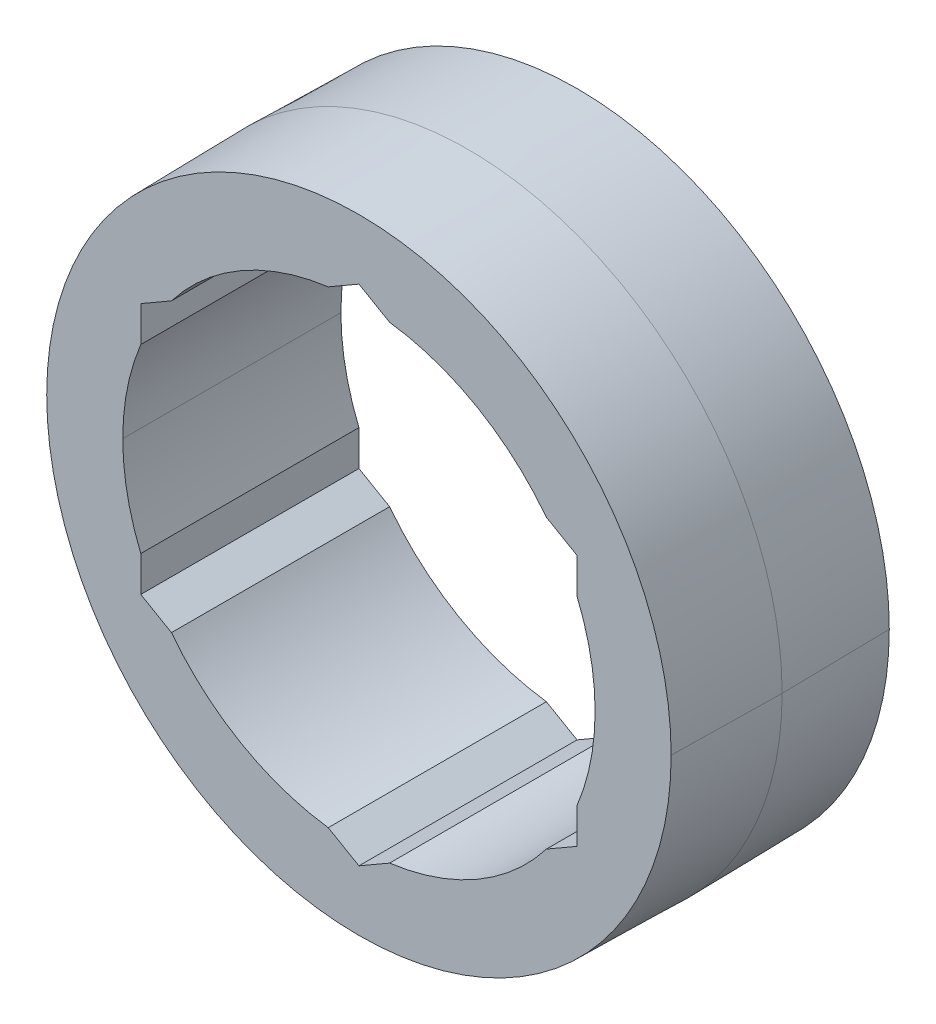
ISO-10303-21;
HEADER;
FILE_DESCRIPTION(('STEP AP214'),'2;1');
FILE_NAME('part.step','',(''),(''),'','','');
FILE_SCHEMA(('AUTOMOTIVE_DESIGN { 1 0 10303 214 1 1 1 1 }'));
ENDSEC;
DATA;
#1=APPLICATION_CONTEXT('core data for automotive mechanical design processes');
#2=APPLICATION_PROTOCOL_DEFINITION('international standard','automotive_design',2000,#1);
#3=PRODUCT_CONTEXT('',#1,'mechanical');
#4=PRODUCT('Part','Part','',(#3));
#5=PRODUCT_RELATED_PRODUCT_CATEGORY('part','',(#4));
#6=PRODUCT_DEFINITION_FORMATION('','',#4);
#7=PRODUCT_DEFINITION_CONTEXT('part definition',#1,'design');
#8=PRODUCT_DEFINITION('design','',#6,#7);
#9=PRODUCT_DEFINITION_SHAPE('','',#8);
#10=(LENGTH_UNIT() NAMED_UNIT(*) SI_UNIT(.MILLI.,.METRE.));
#11=(NAMED_UNIT(*) PLANE_ANGLE_UNIT() SI_UNIT($,.RADIAN.));
#12=(NAMED_UNIT(*) SI_UNIT($,.STERADIAN.) SOLID_ANGLE_UNIT());
#13=UNCERTAINTY_MEASURE_WITH_UNIT(LENGTH_MEASURE(1.E-05),#10,'distance_accuracy_value','');
#14=(GEOMETRIC_REPRESENTATION_CONTEXT(3) GLOBAL_UNCERTAINTY_ASSIGNED_CONTEXT((#13)) GLOBAL_UNIT_ASSIGNED_CONTEXT((#10,
#11,#12)) REPRESENTATION_CONTEXT('',''));
#15=CARTESIAN_POINT('',(0.,0.,0.));
#16=DIRECTION('',(0.,0.,1.));
#17=DIRECTION('',(1.,0.,0.));
#18=AXIS2_PLACEMENT_3D('',#15,#16,#17);
#19=CARTESIAN_POINT('',(0.,0.,-3.175));
#20=DIRECTION('',(0.,0.,1.));
#21=DIRECTION('',(1.,0.,0.));
#22=AXIS2_PLACEMENT_3D('',#19,#20,#21);
#23=PLANE('',#22);
#24=CARTESIAN_POINT('',(0.,0.,-3.175));
#25=DIRECTION('',(0.,0.,1.));
#26=DIRECTION('',(1.,0.,0.));
#27=AXIS2_PLACEMENT_3D('',#24,#25,#26);
#28=CIRCLE('',#27,6.874999966);
#29=CARTESIAN_POINT('',(5.45696042896782,4.18177084608655,-3.175));
#30=VERTEX_POINT('',#29);
#31=CARTESIAN_POINT('',(0.89303957103219,6.81675178197583,-3.175));
#32=VERTEX_POINT('',#31);
#33=EDGE_CURVE('E20',#30,#32,#28,.T.);
#34=ORIENTED_EDGE('',*,*,#33,.T.);
#35=DIRECTION('',(-0.866025403784439,0.5,0.));
#36=VECTOR('',#35,1.);
#37=CARTESIAN_POINT('',(3.175,5.49926131403119,-3.175));
#38=LINE('',#37,#36);
#39=CARTESIAN_POINT('',(0.,7.33234841870825,-3.175));
#40=VERTEX_POINT('',#39);
#41=EDGE_CURVE('E454',#32,#40,#38,.T.);
#42=ORIENTED_EDGE('',*,*,#41,.T.);
#43=DIRECTION('',(-0.866025403784439,-0.5,0.));
#44=VECTOR('',#43,1.);
#45=CARTESIAN_POINT('',(-3.175,5.49926131403119,-3.175));
#46=LINE('',#45,#44);
#47=CARTESIAN_POINT('',(-0.893039571032188,6.81675178197583,-3.175));
#48=VERTEX_POINT('',#47);
#49=EDGE_CURVE('E284',#40,#48,#46,.T.);
#50=ORIENTED_EDGE('',*,*,#49,.T.);
#51=CARTESIAN_POINT('',(0.,0.,-3.175));
#52=DIRECTION('',(0.,0.,1.));
#53=DIRECTION('',(1.,0.,0.));
#54=AXIS2_PLACEMENT_3D('',#51,#52,#53);
#55=CIRCLE('',#54,6.874999966);
#56=CARTESIAN_POINT('',(-5.45696042896781,4.18177084608655,-3.175));
#57=VERTEX_POINT('',#56);
#58=EDGE_CURVE('E385',#48,#57,#55,.T.);
#59=ORIENTED_EDGE('',*,*,#58,.T.);
#60=DIRECTION('',(-0.866025403784439,-0.5,0.));
#61=VECTOR('',#60,1.);
#62=CARTESIAN_POINT('',(-3.175,5.49926131403119,-3.175));
#63=LINE('',#62,#61);
#64=CARTESIAN_POINT('',(-6.35,3.66617420935413,-3.175));
#65=VERTEX_POINT('',#64);
#66=EDGE_CURVE('E402',#57,#65,#63,.T.);
#67=ORIENTED_EDGE('',*,*,#66,.T.);
#68=DIRECTION('',(0.,-1.,0.));
#69=VECTOR('',#68,1.);
#70=CARTESIAN_POINT('',(-6.35,0.,-3.175));
#71=LINE('',#70,#69);
#72=CARTESIAN_POINT('',(-6.35,2.63498093588929,-3.175));
#73=VERTEX_POINT('',#72);
#74=EDGE_CURVE('E458',#65,#73,#71,.T.);
#75=ORIENTED_EDGE('',*,*,#74,.T.);
#76=CARTESIAN_POINT('',(0.,0.,-3.175));
#77=DIRECTION('',(0.,0.,1.));
#78=DIRECTION('',(1.,0.,0.));
#79=AXIS2_PLACEMENT_3D('',#76,#77,#78);
#80=CIRCLE('',#79,6.874999966);
#81=CARTESIAN_POINT('',(-6.874999966,0.,-3.175));
#82=VERTEX_POINT('',#81);
#83=EDGE_CURVE('E375',#73,#82,#80,.T.);
#84=ORIENTED_EDGE('',*,*,#83,.T.);
#85=CARTESIAN_POINT('',(0.,0.,-3.175));
#86=DIRECTION('',(0.,0.,1.));
#87=DIRECTION('',(1.,0.,0.));
#88=AXIS2_PLACEMENT_3D('',#85,#86,#87);
#89=CIRCLE('',#88,6.874999966);
#90=CARTESIAN_POINT('',(-6.35,-2.63498093588929,-3.175));
#91=VERTEX_POINT('',#90);
#92=EDGE_CURVE('E456',#82,#91,#89,.T.);
#93=ORIENTED_EDGE('',*,*,#92,.T.);
#94=DIRECTION('',(0.,-1.,0.));
#95=VECTOR('',#94,1.);
#96=CARTESIAN_POINT('',(-6.35,0.,-3.175));
#97=LINE('',#96,#95);
#98=CARTESIAN_POINT('',(-6.35,-3.66617420935412,-3.175));
#99=VERTEX_POINT('',#98);
#100=EDGE_CURVE('E325',#91,#99,#97,.T.);
#101=ORIENTED_EDGE('',*,*,#100,.T.);
#102=DIRECTION('',(0.866025403784439,-0.5,0.));
#103=VECTOR('',#102,1.);
#104=CARTESIAN_POINT('',(-3.175,-5.49926131403119,-3.175));
#105=LINE('',#104,#103);
#106=CARTESIAN_POINT('',(-5.45696042896782,-4.18177084608655,-3.175));
#107=VERTEX_POINT('',#106);
#108=EDGE_CURVE('E118',#99,#107,#105,.T.);
#109=ORIENTED_EDGE('',*,*,#108,.T.);
#110=CARTESIAN_POINT('',(0.,0.,-3.175));
#111=DIRECTION('',(0.,0.,1.));
#112=DIRECTION('',(1.,0.,0.));
#113=AXIS2_PLACEMENT_3D('',#110,#111,#112);
#114=CIRCLE('',#113,6.874999966);
#115=CARTESIAN_POINT('',(-0.893039571032186,-6.81675178197583,-3.175));
#116=VERTEX_POINT('',#115);
#117=EDGE_CURVE('E367',#107,#116,#114,.T.);
#118=ORIENTED_EDGE('',*,*,#117,.T.);
#119=DIRECTION('',(0.866025403784439,-0.5,0.));
#120=VECTOR('',#119,1.);
#121=CARTESIAN_POINT('',(-3.175,-5.49926131403119,-3.175));
#122=LINE('',#121,#120);
#123=CARTESIAN_POINT('',(0.,-7.33234841870825,-3.175));
#124=VERTEX_POINT('',#123);
#125=EDGE_CURVE('E362',#116,#124,#122,.T.);
#126=ORIENTED_EDGE('',*,*,#125,.T.);
#127=DIRECTION('',(0.866025403784439,0.5,0.));
#128=VECTOR('',#127,1.);
#129=CARTESIAN_POINT('',(3.175,-5.49926131403119,-3.175));
#130=LINE('',#129,#128);
#131=CARTESIAN_POINT('',(0.893039571032181,-6.81675178197583,-3.175));
#132=VERTEX_POINT('',#131);
#133=EDGE_CURVE('E324',#124,#132,#130,.T.);
#134=ORIENTED_EDGE('',*,*,#133,.T.);
#135=CARTESIAN_POINT('',(0.,0.,-3.175));
#136=DIRECTION('',(0.,0.,1.));
#137=DIRECTION('',(1.,0.,0.));
#138=AXIS2_PLACEMENT_3D('',#135,#136,#137);
#139=CIRCLE('',#138,6.874999966);
#140=CARTESIAN_POINT('',(5.45696042896782,-4.18177084608655,-3.175));
#141=VERTEX_POINT('',#140);
#142=EDGE_CURVE('E334',#132,#141,#139,.T.);
#143=ORIENTED_EDGE('',*,*,#142,.T.);
#144=DIRECTION('',(0.866025403784439,0.5,0.));
#145=VECTOR('',#144,1.);
#146=CARTESIAN_POINT('',(3.175,-5.49926131403119,-3.175));
#147=LINE('',#146,#145);
#148=CARTESIAN_POINT('',(6.35,-3.66617420935412,-3.175));
#149=VERTEX_POINT('',#148);
#150=EDGE_CURVE('E396',#141,#149,#147,.T.);
#151=ORIENTED_EDGE('',*,*,#150,.T.);
#152=DIRECTION('',(0.,1.,0.));
#153=VECTOR('',#152,1.);
#154=CARTESIAN_POINT('',(6.35,0.,-3.175));
#155=LINE('',#154,#153);
#156=CARTESIAN_POINT('',(6.35,-2.6349809358893,-3.175));
#157=VERTEX_POINT('',#156);
#158=EDGE_CURVE('E227',#149,#157,#155,.T.);
#159=ORIENTED_EDGE('',*,*,#158,.T.);
#160=CARTESIAN_POINT('',(0.,0.,-3.175));
#161=DIRECTION('',(0.,0.,1.));
#162=DIRECTION('',(1.,0.,0.));
#163=AXIS2_PLACEMENT_3D('',#160,#161,#162);
#164=CIRCLE('',#163,6.874999966);
#165=CARTESIAN_POINT('',(6.35,2.6349809358893,-3.175));
#166=VERTEX_POINT('',#165);
#167=EDGE_CURVE('E298',#157,#166,#164,.T.);
#168=ORIENTED_EDGE('',*,*,#167,.T.);
#169=DIRECTION('',(0.,1.,0.));
#170=VECTOR('',#169,1.);
#171=CARTESIAN_POINT('',(6.35,0.,-3.175));
#172=LINE('',#171,#170);
#173=CARTESIAN_POINT('',(6.35,3.66617420935413,-3.175));
#174=VERTEX_POINT('',#173);
#175=EDGE_CURVE('E156',#166,#174,#172,.T.);
#176=ORIENTED_EDGE('',*,*,#175,.T.);
#177=DIRECTION('',(-0.866025403784439,0.5,0.));
#178=VECTOR('',#177,1.);
#179=CARTESIAN_POINT('',(3.175,5.49926131403119,-3.175));
#180=LINE('',#179,#178);
#181=EDGE_CURVE('E388',#174,#30,#180,.T.);
#182=ORIENTED_EDGE('',*,*,#181,.T.);
#183=EDGE_LOOP('',(#34,#42,#50,#59,#67,#75,#84,#93,#101,#109,#118,#126,#134,#143,#151,#159,#168,
#176,#182));
#184=FACE_BOUND('',#183,.T.);
#185=CARTESIAN_POINT('',(0.,0.,-3.175));
#186=DIRECTION('',(0.,0.,1.));
#187=DIRECTION('',(1.,0.,0.));
#188=AXIS2_PLACEMENT_3D('',#185,#186,#187);
#189=CIRCLE('',#188,9.08858016885291);
#190=CARTESIAN_POINT('',(-9.08858016885291,0.,-3.175));
#191=VERTEX_POINT('',#190);
#192=CARTESIAN_POINT('',(9.08858016885291,0.,-3.175));
#193=VERTEX_POINT('',#192);
#194=EDGE_CURVE('E337',#191,#193,#189,.T.);
#195=ORIENTED_EDGE('',*,*,#194,.F.);
#196=CARTESIAN_POINT('',(0.,0.,-3.175));
#197=DIRECTION('',(0.,0.,1.));
#198=DIRECTION('',(1.,0.,0.));
#199=AXIS2_PLACEMENT_3D('',#196,#197,#198);
#200=CIRCLE('',#199,9.08858016885291);
#201=EDGE_CURVE('E11',#193,#191,#200,.T.);
#202=ORIENTED_EDGE('',*,*,#201,.F.);
#203=EDGE_LOOP('',(#195,#202));
#204=FACE_BOUND('',#203,.T.);
#205=ADVANCED_FACE('F16',(#184,#204),#23,.F.);
#206=CARTESIAN_POINT('',(0.,0.,3.175));
#207=DIRECTION('',(0.,0.,1.));
#208=DIRECTION('',(1.,0.,0.));
#209=AXIS2_PLACEMENT_3D('',#206,#207,#208);
#210=PLANE('',#209);
#211=CARTESIAN_POINT('',(0.,0.,3.175));
#212=DIRECTION('',(0.,0.,1.));
#213=DIRECTION('',(1.,0.,0.));
#214=AXIS2_PLACEMENT_3D('',#211,#212,#213);
#215=CIRCLE('',#214,6.874999966);
#216=CARTESIAN_POINT('',(5.45696042896782,4.18177084608655,3.175));
#217=VERTEX_POINT('',#216);
#218=CARTESIAN_POINT('',(0.89303957103219,6.81675178197583,3.175));
#219=VERTEX_POINT('',#218);
#220=EDGE_CURVE('E259',#217,#219,#215,.T.);
#221=ORIENTED_EDGE('',*,*,#220,.F.);
#222=DIRECTION('',(-0.866025403784439,0.5,0.));
#223=VECTOR('',#222,1.);
#224=CARTESIAN_POINT('',(3.175,5.49926131403119,3.175));
#225=LINE('',#224,#223);
#226=CARTESIAN_POINT('',(6.35,3.66617420935413,3.175));
#227=VERTEX_POINT('',#226);
#228=EDGE_CURVE('E247',#227,#217,#225,.T.);
#229=ORIENTED_EDGE('',*,*,#228,.F.);
#230=DIRECTION('',(0.,1.,0.));
#231=VECTOR('',#230,1.);
#232=CARTESIAN_POINT('',(6.35,0.,3.175));
#233=LINE('',#232,#231);
#234=CARTESIAN_POINT('',(6.35,2.6349809358893,3.175));
#235=VERTEX_POINT('',#234);
#236=EDGE_CURVE('E144',#235,#227,#233,.T.);
#237=ORIENTED_EDGE('',*,*,#236,.F.);
#238=CARTESIAN_POINT('',(0.,0.,3.175));
#239=DIRECTION('',(0.,0.,1.));
#240=DIRECTION('',(1.,0.,0.));
#241=AXIS2_PLACEMENT_3D('',#238,#239,#240);
#242=CIRCLE('',#241,6.874999966);
#243=CARTESIAN_POINT('',(6.35,-2.6349809358893,3.175));
#244=VERTEX_POINT('',#243);
#245=EDGE_CURVE('E240',#244,#235,#242,.T.);
#246=ORIENTED_EDGE('',*,*,#245,.F.);
#247=DIRECTION('',(0.,1.,0.));
#248=VECTOR('',#247,1.);
#249=CARTESIAN_POINT('',(6.35,0.,3.175));
#250=LINE('',#249,#248);
#251=CARTESIAN_POINT('',(6.35,-3.66617420935412,3.175));
#252=VERTEX_POINT('',#251);
#253=EDGE_CURVE('E426',#252,#244,#250,.T.);
#254=ORIENTED_EDGE('',*,*,#253,.F.);
#255=DIRECTION('',(0.866025403784439,0.5,0.));
#256=VECTOR('',#255,1.);
#257=CARTESIAN_POINT('',(3.175,-5.49926131403119,3.175));
#258=LINE('',#257,#256);
#259=CARTESIAN_POINT('',(5.45696042896782,-4.18177084608655,3.175));
#260=VERTEX_POINT('',#259);
#261=EDGE_CURVE('E336',#260,#252,#258,.T.);
#262=ORIENTED_EDGE('',*,*,#261,.F.);
#263=CARTESIAN_POINT('',(0.,0.,3.175));
#264=DIRECTION('',(0.,0.,1.));
#265=DIRECTION('',(1.,0.,0.));
#266=AXIS2_PLACEMENT_3D('',#263,#264,#265);
#267=CIRCLE('',#266,6.874999966);
#268=CARTESIAN_POINT('',(0.893039571032181,-6.81675178197583,3.175));
#269=VERTEX_POINT('',#268);
#270=EDGE_CURVE('E333',#269,#260,#267,.T.);
#271=ORIENTED_EDGE('',*,*,#270,.F.);
#272=DIRECTION('',(0.866025403784439,0.5,0.));
#273=VECTOR('',#272,1.);
#274=CARTESIAN_POINT('',(3.175,-5.49926131403119,3.175));
#275=LINE('',#274,#273);
#276=CARTESIAN_POINT('',(0.,-7.33234841870825,3.175));
#277=VERTEX_POINT('',#276);
#278=EDGE_CURVE('E323',#277,#269,#275,.T.);
#279=ORIENTED_EDGE('',*,*,#278,.F.);
#280=DIRECTION('',(0.866025403784439,-0.5,0.));
#281=VECTOR('',#280,1.);
#282=CARTESIAN_POINT('',(-3.175,-5.49926131403119,3.175));
#283=LINE('',#282,#281);
#284=CARTESIAN_POINT('',(-0.893039571032186,-6.81675178197583,3.175));
#285=VERTEX_POINT('',#284);
#286=EDGE_CURVE('E370',#285,#277,#283,.T.);
#287=ORIENTED_EDGE('',*,*,#286,.F.);
#288=CARTESIAN_POINT('',(0.,0.,3.175));
#289=DIRECTION('',(0.,0.,1.));
#290=DIRECTION('',(1.,0.,0.));
#291=AXIS2_PLACEMENT_3D('',#288,#289,#290);
#292=CIRCLE('',#291,6.874999966);
#293=CARTESIAN_POINT('',(-5.45696042896782,-4.18177084608655,3.175));
#294=VERTEX_POINT('',#293);
#295=EDGE_CURVE('E436',#294,#285,#292,.T.);
#296=ORIENTED_EDGE('',*,*,#295,.F.);
#297=DIRECTION('',(0.866025403784439,-0.5,0.));
#298=VECTOR('',#297,1.);
#299=CARTESIAN_POINT('',(-3.175,-5.49926131403119,3.175));
#300=LINE('',#299,#298);
#301=CARTESIAN_POINT('',(-6.35,-3.66617420935412,3.175));
#302=VERTEX_POINT('',#301);
#303=EDGE_CURVE('E102',#302,#294,#300,.T.);
#304=ORIENTED_EDGE('',*,*,#303,.F.);
#305=DIRECTION('',(0.,-1.,0.));
#306=VECTOR('',#305,1.);
#307=CARTESIAN_POINT('',(-6.35,0.,3.175));
#308=LINE('',#307,#306);
#309=CARTESIAN_POINT('',(-6.35,-2.63498093588929,3.175));
#310=VERTEX_POINT('',#309);
#311=EDGE_CURVE('E279',#310,#302,#308,.T.);
#312=ORIENTED_EDGE('',*,*,#311,.F.);
#313=CARTESIAN_POINT('',(0.,0.,3.175));
#314=DIRECTION('',(0.,0.,1.));
#315=DIRECTION('',(1.,0.,0.));
#316=AXIS2_PLACEMENT_3D('',#313,#314,#315);
#317=CIRCLE('',#316,6.874999966);
#318=CARTESIAN_POINT('',(-6.874999966,0.,3.175));
#319=VERTEX_POINT('',#318);
#320=EDGE_CURVE('E459',#319,#310,#317,.T.);
#321=ORIENTED_EDGE('',*,*,#320,.F.);
#322=CARTESIAN_POINT('',(0.,0.,3.175));
#323=DIRECTION('',(0.,0.,1.));
#324=DIRECTION('',(1.,0.,0.));
#325=AXIS2_PLACEMENT_3D('',#322,#323,#324);
#326=CIRCLE('',#325,6.874999966);
#327=CARTESIAN_POINT('',(-6.35,2.63498093588929,3.175));
#328=VERTEX_POINT('',#327);
#329=EDGE_CURVE('E311',#328,#319,#326,.T.);
#330=ORIENTED_EDGE('',*,*,#329,.F.);
#331=DIRECTION('',(0.,-1.,0.));
#332=VECTOR('',#331,1.);
#333=CARTESIAN_POINT('',(-6.35,0.,3.175));
#334=LINE('',#333,#332);
#335=CARTESIAN_POINT('',(-6.35,3.66617420935413,3.175));
#336=VERTEX_POINT('',#335);
#337=EDGE_CURVE('E422',#336,#328,#334,.T.);
#338=ORIENTED_EDGE('',*,*,#337,.F.);
#339=DIRECTION('',(-0.866025403784439,-0.5,0.));
#340=VECTOR('',#339,1.);
#341=CARTESIAN_POINT('',(-3.175,5.49926131403119,3.175));
#342=LINE('',#341,#340);
#343=CARTESIAN_POINT('',(-5.45696042896781,4.18177084608655,3.175));
#344=VERTEX_POINT('',#343);
#345=EDGE_CURVE('E401',#344,#336,#342,.T.);
#346=ORIENTED_EDGE('',*,*,#345,.F.);
#347=CARTESIAN_POINT('',(0.,0.,3.175));
#348=DIRECTION('',(0.,0.,1.));
#349=DIRECTION('',(1.,0.,0.));
#350=AXIS2_PLACEMENT_3D('',#347,#348,#349);
#351=CIRCLE('',#350,6.874999966);
#352=CARTESIAN_POINT('',(-0.893039571032188,6.81675178197583,3.175));
#353=VERTEX_POINT('',#352);
#354=EDGE_CURVE('E384',#353,#344,#351,.T.);
#355=ORIENTED_EDGE('',*,*,#354,.F.);
#356=DIRECTION('',(-0.866025403784439,-0.5,0.));
#357=VECTOR('',#356,1.);
#358=CARTESIAN_POINT('',(-3.175,5.49926131403119,3.175));
#359=LINE('',#358,#357);
#360=CARTESIAN_POINT('',(0.,7.33234841870825,3.175));
#361=VERTEX_POINT('',#360);
#362=EDGE_CURVE('E283',#361,#353,#359,.T.);
#363=ORIENTED_EDGE('',*,*,#362,.F.);
#364=DIRECTION('',(-0.866025403784439,0.5,0.));
#365=VECTOR('',#364,1.);
#366=CARTESIAN_POINT('',(3.175,5.49926131403119,3.175));
#367=LINE('',#366,#365);
#368=EDGE_CURVE('E27',#219,#361,#367,.T.);
#369=ORIENTED_EDGE('',*,*,#368,.F.);
#370=EDGE_LOOP('',(#221,#229,#237,#246,#254,#262,#271,#279,#287,#296,#304,#312,#321,#330,#338,
#346,#355,#363,#369));
#371=FACE_BOUND('',#370,.T.);
#372=CARTESIAN_POINT('',(0.,0.,3.175));
#373=DIRECTION('',(0.,0.,1.));
#374=DIRECTION('',(1.,0.,0.));
#375=AXIS2_PLACEMENT_3D('',#372,#373,#374);
#376=CIRCLE('',#375,9.08858016885291);
#377=CARTESIAN_POINT('',(9.08858016885291,0.,3.175));
#378=VERTEX_POINT('',#377);
#379=CARTESIAN_POINT('',(-9.08858016885291,0.,3.175));
#380=VERTEX_POINT('',#379);
#381=EDGE_CURVE('E288',#378,#380,#376,.T.);
#382=ORIENTED_EDGE('',*,*,#381,.T.);
#383=CARTESIAN_POINT('',(0.,0.,3.175));
#384=DIRECTION('',(0.,0.,1.));
#385=DIRECTION('',(1.,0.,0.));
#386=AXIS2_PLACEMENT_3D('',#383,#384,#385);
#387=CIRCLE('',#386,9.08858016885291);
#388=EDGE_CURVE('E409',#380,#378,#387,.T.);
#389=ORIENTED_EDGE('',*,*,#388,.T.);
#390=EDGE_LOOP('',(#382,#389));
#391=FACE_BOUND('',#390,.T.);
#392=ADVANCED_FACE('F260',(#371,#391),#210,.T.);
#393=CARTESIAN_POINT('',(0.,0.,0.));
#394=DIRECTION('',(0.,0.,1.));
#395=DIRECTION('',(-1.,0.,0.));
#396=AXIS2_PLACEMENT_3D('',#393,#394,#395);
#397=CONICAL_SURFACE('',#396,9.144,0.0174532925199415);
#398=DIRECTION('',(0.0174524064372835,0.,0.999847695156391));
#399=VECTOR('',#398,1.);
#400=CARTESIAN_POINT('',(9.144,0.,0.));
#401=LINE('',#400,#399);
#402=CARTESIAN_POINT('',(9.144,0.,0.));
#403=VERTEX_POINT('',#402);
#404=EDGE_CURVE('E340',#193,#403,#401,.T.);
#405=ORIENTED_EDGE('',*,*,#404,.F.);
#406=ORIENTED_EDGE('',*,*,#201,.T.);
#407=DIRECTION('',(-0.0174524064372835,0.,0.999847695156391));
#408=VECTOR('',#407,1.);
#409=CARTESIAN_POINT('',(-9.144,0.,0.));
#410=LINE('',#409,#408);
#411=CARTESIAN_POINT('',(-9.144,0.,0.));
#412=VERTEX_POINT('',#411);
#413=EDGE_CURVE('E315',#191,#412,#410,.T.);
#414=ORIENTED_EDGE('',*,*,#413,.T.);
#415=CARTESIAN_POINT('',(0.,0.,0.));
#416=DIRECTION('',(0.,0.,1.));
#417=DIRECTION('',(1.,0.,0.));
#418=AXIS2_PLACEMENT_3D('',#415,#416,#417);
#419=CIRCLE('',#418,9.144);
#420=EDGE_CURVE('E276',#403,#412,#419,.T.);
#421=ORIENTED_EDGE('',*,*,#420,.F.);
#422=EDGE_LOOP('',(#405,#406,#414,#421));
#423=FACE_BOUND('',#422,.T.);
#424=ADVANCED_FACE('F532',(#423),#397,.T.);
#425=CARTESIAN_POINT('',(3.175,5.49926131403119,3.175));
#426=DIRECTION('',(-0.5,-0.866025403784439,0.));
#427=DIRECTION('',(-0.866025403784439,0.5,0.));
#428=AXIS2_PLACEMENT_3D('',#425,#426,#427);
#429=PLANE('',#428);
#430=ORIENTED_EDGE('',*,*,#41,.F.);
#431=DIRECTION('',(0.,0.,-1.));
#432=VECTOR('',#431,1.);
#433=CARTESIAN_POINT('',(0.89303957103219,6.81675178197583,3.175));
#434=LINE('',#433,#432);
#435=EDGE_CURVE('E265',#219,#32,#434,.T.);
#436=ORIENTED_EDGE('',*,*,#435,.F.);
#437=ORIENTED_EDGE('',*,*,#368,.T.);
#438=DIRECTION('',(0.,0.,-1.));
#439=VECTOR('',#438,1.);
#440=CARTESIAN_POINT('',(0.,7.33234841870825,3.175));
#441=LINE('',#440,#439);
#442=EDGE_CURVE('E281',#361,#40,#441,.T.);
#443=ORIENTED_EDGE('',*,*,#442,.T.);
#444=EDGE_LOOP('',(#430,#436,#437,#443));
#445=FACE_BOUND('',#444,.T.);
#446=ADVANCED_FACE('F565',(#445),#429,.T.);
#447=CARTESIAN_POINT('',(-3.175,5.49926131403119,3.175));
#448=DIRECTION('',(0.5,-0.866025403784439,0.));
#449=DIRECTION('',(0.,0.,-1.));
#450=AXIS2_PLACEMENT_3D('',#447,#448,#449);
#451=PLANE('',#450);
#452=ORIENTED_EDGE('',*,*,#49,.F.);
#453=ORIENTED_EDGE('',*,*,#442,.F.);
#454=ORIENTED_EDGE('',*,*,#362,.T.);
#455=DIRECTION('',(0.,0.,-1.));
#456=VECTOR('',#455,1.);
#457=CARTESIAN_POINT('',(-0.893039571032188,6.81675178197583,3.175));
#458=LINE('',#457,#456);
#459=EDGE_CURVE('E380',#353,#48,#458,.T.);
#460=ORIENTED_EDGE('',*,*,#459,.T.);
#461=EDGE_LOOP('',(#452,#453,#454,#460));
#462=FACE_BOUND('',#461,.T.);
#463=ADVANCED_FACE('F569',(#462),#451,.T.);
#464=CARTESIAN_POINT('',(0.,0.,3.175));
#465=DIRECTION('',(0.,0.,-1.));
#466=DIRECTION('',(-1.,0.,0.));
#467=AXIS2_PLACEMENT_3D('',#464,#465,#466);
#468=CYLINDRICAL_SURFACE('',#467,6.874999966);
#469=ORIENTED_EDGE('',*,*,#58,.F.);
#470=ORIENTED_EDGE('',*,*,#459,.F.);
#471=ORIENTED_EDGE('',*,*,#354,.T.);
#472=DIRECTION('',(0.,0.,-1.));
#473=VECTOR('',#472,1.);
#474=CARTESIAN_POINT('',(-5.45696042896781,4.18177084608655,3.175));
#475=LINE('',#474,#473);
#476=EDGE_CURVE('E397',#344,#57,#475,.T.);
#477=ORIENTED_EDGE('',*,*,#476,.T.);
#478=EDGE_LOOP('',(#469,#470,#471,#477));
#479=FACE_BOUND('',#478,.T.);
#480=ADVANCED_FACE('F588',(#479),#468,.F.);
#481=CARTESIAN_POINT('',(-3.175,5.49926131403119,3.175));
#482=DIRECTION('',(0.5,-0.866025403784439,0.));
#483=DIRECTION('',(0.,0.,-1.));
#484=AXIS2_PLACEMENT_3D('',#481,#482,#483);
#485=PLANE('',#484);
#486=ORIENTED_EDGE('',*,*,#66,.F.);
#487=ORIENTED_EDGE('',*,*,#476,.F.);
#488=ORIENTED_EDGE('',*,*,#345,.T.);
#489=DIRECTION('',(0.,0.,-1.));
#490=VECTOR('',#489,1.);
#491=CARTESIAN_POINT('',(-6.35,3.66617420935413,3.175));
#492=LINE('',#491,#490);
#493=EDGE_CURVE('E425',#336,#65,#492,.T.);
#494=ORIENTED_EDGE('',*,*,#493,.T.);
#495=EDGE_LOOP('',(#486,#487,#488,#494));
#496=FACE_BOUND('',#495,.T.);
#497=ADVANCED_FACE('F578',(#496),#485,.T.);
#498=CARTESIAN_POINT('',(-6.35,0.,3.175));
#499=DIRECTION('',(1.,0.,0.));
#500=DIRECTION('',(0.,-1.,0.));
#501=AXIS2_PLACEMENT_3D('',#498,#499,#500);
#502=PLANE('',#501);
#503=ORIENTED_EDGE('',*,*,#74,.F.);
#504=ORIENTED_EDGE('',*,*,#493,.F.);
#505=ORIENTED_EDGE('',*,*,#337,.T.);
#506=DIRECTION('',(0.,0.,-1.));
#507=VECTOR('',#506,1.);
#508=CARTESIAN_POINT('',(-6.35,2.63498093588929,3.175));
#509=LINE('',#508,#507);
#510=EDGE_CURVE('E379',#328,#73,#509,.T.);
#511=ORIENTED_EDGE('',*,*,#510,.T.);
#512=EDGE_LOOP('',(#503,#504,#505,#511));
#513=FACE_BOUND('',#512,.T.);
#514=ADVANCED_FACE('F575',(#513),#502,.T.);
#515=CARTESIAN_POINT('',(0.,0.,3.175));
#516=DIRECTION('',(0.,0.,-1.));
#517=DIRECTION('',(-1.,0.,0.));
#518=AXIS2_PLACEMENT_3D('',#515,#516,#517);
#519=CYLINDRICAL_SURFACE('',#518,6.874999966);
#520=DIRECTION('',(0.,0.,-1.));
#521=VECTOR('',#520,1.);
#522=CARTESIAN_POINT('',(-6.874999966,0.,3.175));
#523=LINE('',#522,#521);
#524=EDGE_CURVE('E314',#319,#82,#523,.T.);
#525=ORIENTED_EDGE('',*,*,#524,.F.);
#526=ORIENTED_EDGE('',*,*,#320,.T.);
#527=DIRECTION('',(0.,0.,-1.));
#528=VECTOR('',#527,1.);
#529=CARTESIAN_POINT('',(-6.35,-2.63498093588929,3.175));
#530=LINE('',#529,#528);
#531=EDGE_CURVE('E328',#310,#91,#530,.T.);
#532=ORIENTED_EDGE('',*,*,#531,.T.);
#533=ORIENTED_EDGE('',*,*,#92,.F.);
#534=EDGE_LOOP('',(#525,#526,#532,#533));
#535=FACE_BOUND('',#534,.T.);
#536=ADVANCED_FACE('F543',(#535),#519,.F.);
#537=CARTESIAN_POINT('',(-6.35,0.,3.175));
#538=DIRECTION('',(1.,0.,0.));
#539=DIRECTION('',(0.,-1.,0.));
#540=AXIS2_PLACEMENT_3D('',#537,#538,#539);
#541=PLANE('',#540);
#542=ORIENTED_EDGE('',*,*,#100,.F.);
#543=ORIENTED_EDGE('',*,*,#531,.F.);
#544=ORIENTED_EDGE('',*,*,#311,.T.);
#545=DIRECTION('',(0.,0.,-1.));
#546=VECTOR('',#545,1.);
#547=CARTESIAN_POINT('',(-6.35,-3.66617420935412,3.175));
#548=LINE('',#547,#546);
#549=EDGE_CURVE('E435',#302,#99,#548,.T.);
#550=ORIENTED_EDGE('',*,*,#549,.T.);
#551=EDGE_LOOP('',(#542,#543,#544,#550));
#552=FACE_BOUND('',#551,.T.);
#553=ADVANCED_FACE('F540',(#552),#541,.T.);
#554=CARTESIAN_POINT('',(-3.175,-5.49926131403119,3.175));
#555=DIRECTION('',(0.5,0.866025403784439,0.));
#556=DIRECTION('',(0.,0.,-1.));
#557=AXIS2_PLACEMENT_3D('',#554,#555,#556);
#558=PLANE('',#557);
#559=ORIENTED_EDGE('',*,*,#108,.F.);
#560=ORIENTED_EDGE('',*,*,#549,.F.);
#561=ORIENTED_EDGE('',*,*,#303,.T.);
#562=DIRECTION('',(0.,0.,-1.));
#563=VECTOR('',#562,1.);
#564=CARTESIAN_POINT('',(-5.45696042896782,-4.18177084608655,3.175));
#565=LINE('',#564,#563);
#566=EDGE_CURVE('E369',#294,#107,#565,.T.);
#567=ORIENTED_EDGE('',*,*,#566,.T.);
#568=EDGE_LOOP('',(#559,#560,#561,#567));
#569=FACE_BOUND('',#568,.T.);
#570=ADVANCED_FACE('F539',(#569),#558,.T.);
#571=CARTESIAN_POINT('',(0.,0.,3.175));
#572=DIRECTION('',(0.,0.,-1.));
#573=DIRECTION('',(-1.,0.,0.));
#574=AXIS2_PLACEMENT_3D('',#571,#572,#573);
#575=CYLINDRICAL_SURFACE('',#574,6.874999966);
#576=ORIENTED_EDGE('',*,*,#117,.F.);
#577=ORIENTED_EDGE('',*,*,#566,.F.);
#578=ORIENTED_EDGE('',*,*,#295,.T.);
#579=DIRECTION('',(0.,0.,-1.));
#580=VECTOR('',#579,1.);
#581=CARTESIAN_POINT('',(-0.893039571032186,-6.81675178197583,3.175));
#582=LINE('',#581,#580);
#583=EDGE_CURVE('E363',#285,#116,#582,.T.);
#584=ORIENTED_EDGE('',*,*,#583,.T.);
#585=EDGE_LOOP('',(#576,#577,#578,#584));
#586=FACE_BOUND('',#585,.T.);
#587=ADVANCED_FACE('F496',(#586),#575,.F.);
#588=CARTESIAN_POINT('',(-3.175,-5.49926131403119,3.175));
#589=DIRECTION('',(0.5,0.866025403784439,0.));
#590=DIRECTION('',(0.,0.,-1.));
#591=AXIS2_PLACEMENT_3D('',#588,#589,#590);
#592=PLANE('',#591);
#593=ORIENTED_EDGE('',*,*,#125,.F.);
#594=ORIENTED_EDGE('',*,*,#583,.F.);
#595=ORIENTED_EDGE('',*,*,#286,.T.);
#596=DIRECTION('',(0.,0.,-1.));
#597=VECTOR('',#596,1.);
#598=CARTESIAN_POINT('',(0.,-7.33234841870825,3.175));
#599=LINE('',#598,#597);
#600=EDGE_CURVE('E319',#277,#124,#599,.T.);
#601=ORIENTED_EDGE('',*,*,#600,.T.);
#602=EDGE_LOOP('',(#593,#594,#595,#601));
#603=FACE_BOUND('',#602,.T.);
#604=ADVANCED_FACE('F498',(#603),#592,.T.);
#605=CARTESIAN_POINT('',(3.175,-5.49926131403119,3.175));
#606=DIRECTION('',(-0.5,0.866025403784439,0.));
#607=DIRECTION('',(0.,0.,1.));
#608=AXIS2_PLACEMENT_3D('',#605,#606,#607);
#609=PLANE('',#608);
#610=ORIENTED_EDGE('',*,*,#133,.F.);
#611=ORIENTED_EDGE('',*,*,#600,.F.);
#612=ORIENTED_EDGE('',*,*,#278,.T.);
#613=DIRECTION('',(0.,0.,-1.));
#614=VECTOR('',#613,1.);
#615=CARTESIAN_POINT('',(0.893039571032181,-6.81675178197583,3.175));
#616=LINE('',#615,#614);
#617=EDGE_CURVE('E329',#269,#132,#616,.T.);
#618=ORIENTED_EDGE('',*,*,#617,.T.);
#619=EDGE_LOOP('',(#610,#611,#612,#618));
#620=FACE_BOUND('',#619,.T.);
#621=ADVANCED_FACE('F505',(#620),#609,.T.);
#622=CARTESIAN_POINT('',(0.,0.,3.175));
#623=DIRECTION('',(0.,0.,-1.));
#624=DIRECTION('',(-1.,0.,0.));
#625=AXIS2_PLACEMENT_3D('',#622,#623,#624);
#626=CYLINDRICAL_SURFACE('',#625,6.874999966);
#627=ORIENTED_EDGE('',*,*,#142,.F.);
#628=ORIENTED_EDGE('',*,*,#617,.F.);
#629=ORIENTED_EDGE('',*,*,#270,.T.);
#630=DIRECTION('',(0.,0.,-1.));
#631=VECTOR('',#630,1.);
#632=CARTESIAN_POINT('',(5.45696042896782,-4.18177084608655,3.175));
#633=LINE('',#632,#631);
#634=EDGE_CURVE('E392',#260,#141,#633,.T.);
#635=ORIENTED_EDGE('',*,*,#634,.T.);
#636=EDGE_LOOP('',(#627,#628,#629,#635));
#637=FACE_BOUND('',#636,.T.);
#638=ADVANCED_FACE('F509',(#637),#626,.F.);
#639=CARTESIAN_POINT('',(3.175,-5.49926131403119,3.175));
#640=DIRECTION('',(-0.5,0.866025403784439,0.));
#641=DIRECTION('',(0.,0.,1.));
#642=AXIS2_PLACEMENT_3D('',#639,#640,#641);
#643=PLANE('',#642);
#644=ORIENTED_EDGE('',*,*,#150,.F.);
#645=ORIENTED_EDGE('',*,*,#634,.F.);
#646=ORIENTED_EDGE('',*,*,#261,.T.);
#647=DIRECTION('',(0.,0.,-1.));
#648=VECTOR('',#647,1.);
#649=CARTESIAN_POINT('',(6.35,-3.66617420935412,3.175));
#650=LINE('',#649,#648);
#651=EDGE_CURVE('E295',#252,#149,#650,.T.);
#652=ORIENTED_EDGE('',*,*,#651,.T.);
#653=EDGE_LOOP('',(#644,#645,#646,#652));
#654=FACE_BOUND('',#653,.T.);
#655=ADVANCED_FACE('F514',(#654),#643,.T.);
#656=CARTESIAN_POINT('',(6.35,0.,3.175));
#657=DIRECTION('',(-1.,0.,0.));
#658=DIRECTION('',(0.,1.,0.));
#659=AXIS2_PLACEMENT_3D('',#656,#657,#658);
#660=PLANE('',#659);
#661=ORIENTED_EDGE('',*,*,#158,.F.);
#662=ORIENTED_EDGE('',*,*,#651,.F.);
#663=ORIENTED_EDGE('',*,*,#253,.T.);
#664=DIRECTION('',(0.,0.,-1.));
#665=VECTOR('',#664,1.);
#666=CARTESIAN_POINT('',(6.35,-2.6349809358893,3.175));
#667=LINE('',#666,#665);
#668=EDGE_CURVE('E291',#244,#157,#667,.T.);
#669=ORIENTED_EDGE('',*,*,#668,.T.);
#670=EDGE_LOOP('',(#661,#662,#663,#669));
#671=FACE_BOUND('',#670,.T.);
#672=ADVANCED_FACE('F18',(#671),#660,.T.);
#673=CARTESIAN_POINT('',(0.,0.,3.175));
#674=DIRECTION('',(0.,0.,-1.));
#675=DIRECTION('',(-1.,0.,0.));
#676=AXIS2_PLACEMENT_3D('',#673,#674,#675);
#677=CYLINDRICAL_SURFACE('',#676,6.874999966);
#678=ORIENTED_EDGE('',*,*,#167,.F.);
#679=ORIENTED_EDGE('',*,*,#668,.F.);
#680=ORIENTED_EDGE('',*,*,#245,.T.);
#681=DIRECTION('',(0.,0.,-1.));
#682=VECTOR('',#681,1.);
#683=CARTESIAN_POINT('',(6.35,2.6349809358893,3.175));
#684=LINE('',#683,#682);
#685=EDGE_CURVE('E316',#235,#166,#684,.T.);
#686=ORIENTED_EDGE('',*,*,#685,.T.);
#687=EDGE_LOOP('',(#678,#679,#680,#686));
#688=FACE_BOUND('',#687,.T.);
#689=ADVANCED_FACE('F518',(#688),#677,.F.);
#690=CARTESIAN_POINT('',(6.35,0.,3.175));
#691=DIRECTION('',(-1.,0.,0.));
#692=DIRECTION('',(0.,1.,0.));
#693=AXIS2_PLACEMENT_3D('',#690,#691,#692);
#694=PLANE('',#693);
#695=ORIENTED_EDGE('',*,*,#175,.F.);
#696=ORIENTED_EDGE('',*,*,#685,.F.);
#697=ORIENTED_EDGE('',*,*,#236,.T.);
#698=DIRECTION('',(0.,0.,-1.));
#699=VECTOR('',#698,1.);
#700=CARTESIAN_POINT('',(6.35,3.66617420935413,3.175));
#701=LINE('',#700,#699);
#702=EDGE_CURVE('E254',#227,#174,#701,.T.);
#703=ORIENTED_EDGE('',*,*,#702,.T.);
#704=EDGE_LOOP('',(#695,#696,#697,#703));
#705=FACE_BOUND('',#704,.T.);
#706=ADVANCED_FACE('F524',(#705),#694,.T.);
#707=CARTESIAN_POINT('',(3.175,5.49926131403119,3.175));
#708=DIRECTION('',(-0.5,-0.866025403784439,0.));
#709=DIRECTION('',(-0.866025403784439,0.5,0.));
#710=AXIS2_PLACEMENT_3D('',#707,#708,#709);
#711=PLANE('',#710);
#712=ORIENTED_EDGE('',*,*,#181,.F.);
#713=ORIENTED_EDGE('',*,*,#702,.F.);
#714=ORIENTED_EDGE('',*,*,#228,.T.);
#715=DIRECTION('',(0.,0.,-1.));
#716=VECTOR('',#715,1.);
#717=CARTESIAN_POINT('',(5.45696042896782,4.18177084608655,3.175));
#718=LINE('',#717,#716);
#719=EDGE_CURVE('E252',#217,#30,#718,.T.);
#720=ORIENTED_EDGE('',*,*,#719,.T.);
#721=EDGE_LOOP('',(#712,#713,#714,#720));
#722=FACE_BOUND('',#721,.T.);
#723=ADVANCED_FACE('F250',(#722),#711,.T.);
#724=CARTESIAN_POINT('',(0.,0.,3.175));
#725=DIRECTION('',(0.,0.,-1.));
#726=DIRECTION('',(-1.,0.,0.));
#727=AXIS2_PLACEMENT_3D('',#724,#725,#726);
#728=CYLINDRICAL_SURFACE('',#727,6.874999966);
#729=ORIENTED_EDGE('',*,*,#33,.F.);
#730=ORIENTED_EDGE('',*,*,#719,.F.);
#731=ORIENTED_EDGE('',*,*,#220,.T.);
#732=ORIENTED_EDGE('',*,*,#435,.T.);
#733=EDGE_LOOP('',(#729,#730,#731,#732));
#734=FACE_BOUND('',#733,.T.);
#735=ADVANCED_FACE('F267',(#734),#728,.F.);
#736=CARTESIAN_POINT('',(0.,0.,0.));
#737=DIRECTION('',(0.,0.,-1.));
#738=DIRECTION('',(1.,0.,0.));
#739=AXIS2_PLACEMENT_3D('',#736,#737,#738);
#740=CONICAL_SURFACE('',#739,9.144,0.0174532925199415);
#741=DIRECTION('',(-0.0174524064372835,0.,-0.999847695156391));
#742=VECTOR('',#741,1.);
#743=CARTESIAN_POINT('',(-9.144,0.,0.));
#744=LINE('',#743,#742);
#745=EDGE_CURVE('E289',#380,#412,#744,.T.);
#746=ORIENTED_EDGE('',*,*,#745,.F.);
#747=ORIENTED_EDGE('',*,*,#381,.F.);
#748=DIRECTION('',(0.0174524064372835,0.,-0.999847695156391));
#749=VECTOR('',#748,1.);
#750=CARTESIAN_POINT('',(9.144,0.,0.));
#751=LINE('',#750,#749);
#752=EDGE_CURVE('E285',#378,#403,#751,.T.);
#753=ORIENTED_EDGE('',*,*,#752,.T.);
#754=ORIENTED_EDGE('',*,*,#420,.T.);
#755=EDGE_LOOP('',(#746,#747,#753,#754));
#756=FACE_BOUND('',#755,.T.);
#757=ADVANCED_FACE('F551',(#756),#740,.T.);
#758=CARTESIAN_POINT('',(0.,0.,0.));
#759=DIRECTION('',(0.,0.,-1.));
#760=DIRECTION('',(1.,0.,0.));
#761=AXIS2_PLACEMENT_3D('',#758,#759,#760);
#762=CONICAL_SURFACE('',#761,9.144,0.0174532925199415);
#763=ORIENTED_EDGE('',*,*,#388,.F.);
#764=ORIENTED_EDGE('',*,*,#745,.T.);
#765=CARTESIAN_POINT('',(0.,0.,0.));
#766=DIRECTION('',(0.,0.,1.));
#767=DIRECTION('',(1.,0.,0.));
#768=AXIS2_PLACEMENT_3D('',#765,#766,#767);
#769=CIRCLE('',#768,9.144);
#770=EDGE_CURVE('E348',#412,#403,#769,.T.);
#771=ORIENTED_EDGE('',*,*,#770,.T.);
#772=ORIENTED_EDGE('',*,*,#752,.F.);
#773=EDGE_LOOP('',(#763,#764,#771,#772));
#774=FACE_BOUND('',#773,.T.);
#775=ADVANCED_FACE('F549',(#774),#762,.T.);
#776=CARTESIAN_POINT('',(0.,0.,3.175));
#777=DIRECTION('',(0.,0.,-1.));
#778=DIRECTION('',(-1.,0.,0.));
#779=AXIS2_PLACEMENT_3D('',#776,#777,#778);
#780=CYLINDRICAL_SURFACE('',#779,6.874999966);
#781=ORIENTED_EDGE('',*,*,#329,.T.);
#782=ORIENTED_EDGE('',*,*,#524,.T.);
#783=ORIENTED_EDGE('',*,*,#83,.F.);
#784=ORIENTED_EDGE('',*,*,#510,.F.);
#785=EDGE_LOOP('',(#781,#782,#783,#784));
#786=FACE_BOUND('',#785,.T.);
#787=ADVANCED_FACE('F548',(#786),#780,.F.);
#788=CARTESIAN_POINT('',(0.,0.,0.));
#789=DIRECTION('',(0.,0.,1.));
#790=DIRECTION('',(-1.,0.,0.));
#791=AXIS2_PLACEMENT_3D('',#788,#789,#790);
#792=CONICAL_SURFACE('',#791,9.144,0.0174532925199415);
#793=ORIENTED_EDGE('',*,*,#194,.T.);
#794=ORIENTED_EDGE('',*,*,#404,.T.);
#795=ORIENTED_EDGE('',*,*,#770,.F.);
#796=ORIENTED_EDGE('',*,*,#413,.F.);
#797=EDGE_LOOP('',(#793,#794,#795,#796));
#798=FACE_BOUND('',#797,.T.);
#799=ADVANCED_FACE('F545',(#798),#792,.T.);
#800=CLOSED_SHELL('',(#205,#392,#424,#446,#463,#480,#497,#514,#536,#553,#570,#587,#604,#621,
#638,#655,#672,#689,#706,#723,#735,#757,#775,#787,#799));
#801=MANIFOLD_SOLID_BREP('B1',#800);
#802=ADVANCED_BREP_SHAPE_REPRESENTATION('',(#18,#801),#14);
#803=SHAPE_DEFINITION_REPRESENTATION(#9,#802);
ENDSEC;
END-ISO-10303-21;
